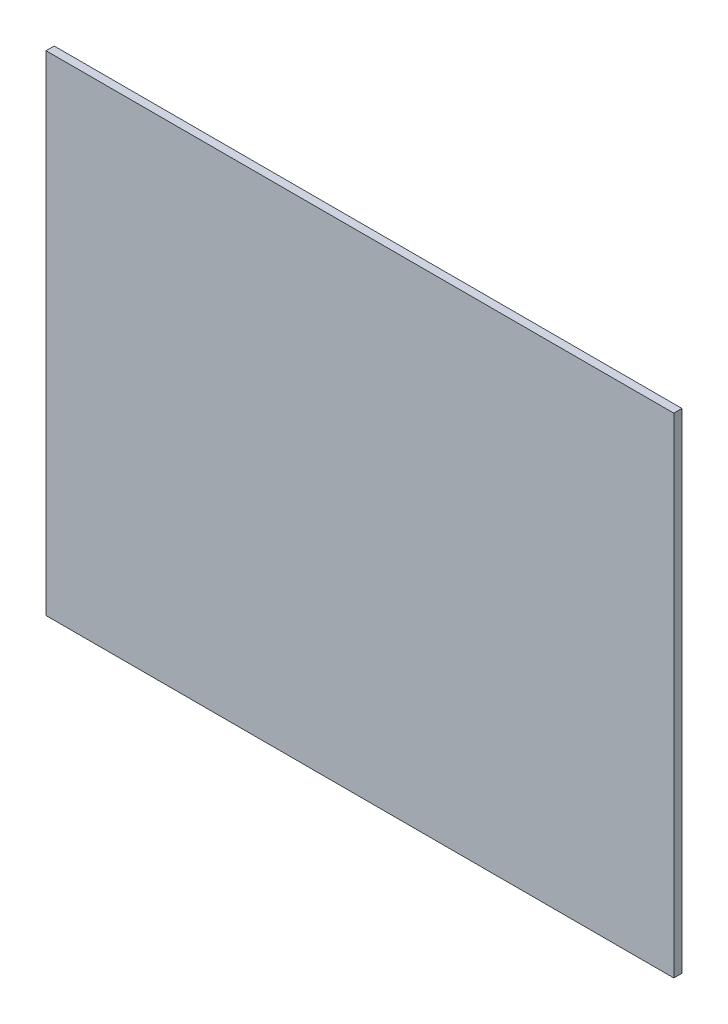
ISO-10303-21;
HEADER;
FILE_DESCRIPTION(('STEP AP214'),'2;1');
FILE_NAME('part.step','',(''),(''),'','','');
FILE_SCHEMA(('AUTOMOTIVE_DESIGN { 1 0 10303 214 1 1 1 1 }'));
ENDSEC;
DATA;
#1=APPLICATION_CONTEXT('core data for automotive mechanical design processes');
#2=APPLICATION_PROTOCOL_DEFINITION('international standard','automotive_design',2000,#1);
#3=PRODUCT_CONTEXT('',#1,'mechanical');
#4=PRODUCT('Part','Part','',(#3));
#5=PRODUCT_RELATED_PRODUCT_CATEGORY('part','',(#4));
#6=PRODUCT_DEFINITION_FORMATION('','',#4);
#7=PRODUCT_DEFINITION_CONTEXT('part definition',#1,'design');
#8=PRODUCT_DEFINITION('design','',#6,#7);
#9=PRODUCT_DEFINITION_SHAPE('','',#8);
#10=(LENGTH_UNIT() NAMED_UNIT(*) SI_UNIT(.MILLI.,.METRE.));
#11=(NAMED_UNIT(*) PLANE_ANGLE_UNIT() SI_UNIT($,.RADIAN.));
#12=(NAMED_UNIT(*) SI_UNIT($,.STERADIAN.) SOLID_ANGLE_UNIT());
#13=UNCERTAINTY_MEASURE_WITH_UNIT(LENGTH_MEASURE(1.E-05),#10,'distance_accuracy_value','');
#14=(GEOMETRIC_REPRESENTATION_CONTEXT(3) GLOBAL_UNCERTAINTY_ASSIGNED_CONTEXT((#13)) GLOBAL_UNIT_ASSIGNED_CONTEXT((#10,
#11,#12)) REPRESENTATION_CONTEXT('',''));
#15=CARTESIAN_POINT('',(0.,0.,0.));
#16=DIRECTION('',(0.,0.,1.));
#17=DIRECTION('',(1.,0.,0.));
#18=AXIS2_PLACEMENT_3D('',#15,#16,#17);
#19=CARTESIAN_POINT('',(-590.,300.,10.));
#20=DIRECTION('',(1.,0.,0.));
#21=DIRECTION('',(0.,1.,0.));
#22=AXIS2_PLACEMENT_3D('',#19,#20,#21);
#23=PLANE('',#22);
#24=DIRECTION('',(0.,-1.,0.));
#25=VECTOR('',#24,1.);
#26=CARTESIAN_POINT('',(-590.,300.,0.));
#27=LINE('',#26,#25);
#28=CARTESIAN_POINT('',(-590.,300.,0.));
#29=VERTEX_POINT('',#28);
#30=CARTESIAN_POINT('',(-590.,-300.,0.));
#31=VERTEX_POINT('',#30);
#32=EDGE_CURVE('E96',#29,#31,#27,.T.);
#33=ORIENTED_EDGE('',*,*,#32,.T.);
#34=DIRECTION('',(0.,0.,-1.));
#35=VECTOR('',#34,1.);
#36=CARTESIAN_POINT('',(-590.,-300.,10.));
#37=LINE('',#36,#35);
#38=CARTESIAN_POINT('',(-590.,-300.,10.));
#39=VERTEX_POINT('',#38);
#40=EDGE_CURVE('E11',#39,#31,#37,.T.);
#41=ORIENTED_EDGE('',*,*,#40,.F.);
#42=DIRECTION('',(0.,-1.,0.));
#43=VECTOR('',#42,1.);
#44=CARTESIAN_POINT('',(-590.,300.,10.));
#45=LINE('',#44,#43);
#46=CARTESIAN_POINT('',(-590.,300.,10.));
#47=VERTEX_POINT('',#46);
#48=EDGE_CURVE('E84',#47,#39,#45,.T.);
#49=ORIENTED_EDGE('',*,*,#48,.F.);
#50=DIRECTION('',(0.,0.,-1.));
#51=VECTOR('',#50,1.);
#52=CARTESIAN_POINT('',(-590.,300.,10.));
#53=LINE('',#52,#51);
#54=EDGE_CURVE('E92',#47,#29,#53,.T.);
#55=ORIENTED_EDGE('',*,*,#54,.T.);
#56=EDGE_LOOP('',(#33,#41,#49,#55));
#57=FACE_BOUND('',#56,.T.);
#58=ADVANCED_FACE('F33',(#57),#23,.F.);
#59=CARTESIAN_POINT('',(-590.,-300.,10.));
#60=DIRECTION('',(0.,1.,0.));
#61=DIRECTION('',(0.,0.,1.));
#62=AXIS2_PLACEMENT_3D('',#59,#60,#61);
#63=PLANE('',#62);
#64=DIRECTION('',(1.,0.,0.));
#65=VECTOR('',#64,1.);
#66=CARTESIAN_POINT('',(-590.,-300.,0.));
#67=LINE('',#66,#65);
#68=CARTESIAN_POINT('',(180.,-300.,0.));
#69=VERTEX_POINT('',#68);
#70=EDGE_CURVE('E88',#31,#69,#67,.T.);
#71=ORIENTED_EDGE('',*,*,#70,.T.);
#72=DIRECTION('',(0.,0.,-1.));
#73=VECTOR('',#72,1.);
#74=CARTESIAN_POINT('',(180.,-300.,10.));
#75=LINE('',#74,#73);
#76=CARTESIAN_POINT('',(180.,-300.,10.));
#77=VERTEX_POINT('',#76);
#78=EDGE_CURVE('E41',#77,#69,#75,.T.);
#79=ORIENTED_EDGE('',*,*,#78,.F.);
#80=DIRECTION('',(1.,0.,0.));
#81=VECTOR('',#80,1.);
#82=CARTESIAN_POINT('',(-590.,-300.,10.));
#83=LINE('',#82,#81);
#84=EDGE_CURVE('E79',#39,#77,#83,.T.);
#85=ORIENTED_EDGE('',*,*,#84,.F.);
#86=ORIENTED_EDGE('',*,*,#40,.T.);
#87=EDGE_LOOP('',(#71,#79,#85,#86));
#88=FACE_BOUND('',#87,.T.);
#89=ADVANCED_FACE('F87',(#88),#63,.F.);
#90=CARTESIAN_POINT('',(180.,300.,10.));
#91=DIRECTION('',(-1.,0.,0.));
#92=DIRECTION('',(0.,-1.,0.));
#93=AXIS2_PLACEMENT_3D('',#90,#91,#92);
#94=PLANE('',#93);
#95=DIRECTION('',(0.,1.,0.));
#96=VECTOR('',#95,1.);
#97=CARTESIAN_POINT('',(180.,300.,0.));
#98=LINE('',#97,#96);
#99=CARTESIAN_POINT('',(180.,300.,0.));
#100=VERTEX_POINT('',#99);
#101=EDGE_CURVE('E66',#69,#100,#98,.T.);
#102=ORIENTED_EDGE('',*,*,#101,.T.);
#103=DIRECTION('',(0.,0.,-1.));
#104=VECTOR('',#103,1.);
#105=CARTESIAN_POINT('',(180.,300.,10.));
#106=LINE('',#105,#104);
#107=CARTESIAN_POINT('',(180.,300.,10.));
#108=VERTEX_POINT('',#107);
#109=EDGE_CURVE('E89',#108,#100,#106,.T.);
#110=ORIENTED_EDGE('',*,*,#109,.F.);
#111=DIRECTION('',(0.,1.,0.));
#112=VECTOR('',#111,1.);
#113=CARTESIAN_POINT('',(180.,300.,10.));
#114=LINE('',#113,#112);
#115=EDGE_CURVE('E82',#77,#108,#114,.T.);
#116=ORIENTED_EDGE('',*,*,#115,.F.);
#117=ORIENTED_EDGE('',*,*,#78,.T.);
#118=EDGE_LOOP('',(#102,#110,#116,#117));
#119=FACE_BOUND('',#118,.T.);
#120=ADVANCED_FACE('F90',(#119),#94,.F.);
#121=CARTESIAN_POINT('',(-590.,300.,10.));
#122=DIRECTION('',(0.,-1.,0.));
#123=DIRECTION('',(1.,0.,0.));
#124=AXIS2_PLACEMENT_3D('',#121,#122,#123);
#125=PLANE('',#124);
#126=DIRECTION('',(-1.,0.,0.));
#127=VECTOR('',#126,1.);
#128=CARTESIAN_POINT('',(-590.,300.,0.));
#129=LINE('',#128,#127);
#130=EDGE_CURVE('E72',#100,#29,#129,.T.);
#131=ORIENTED_EDGE('',*,*,#130,.T.);
#132=ORIENTED_EDGE('',*,*,#54,.F.);
#133=DIRECTION('',(-1.,0.,0.));
#134=VECTOR('',#133,1.);
#135=CARTESIAN_POINT('',(-590.,300.,10.));
#136=LINE('',#135,#134);
#137=EDGE_CURVE('E49',#108,#47,#136,.T.);
#138=ORIENTED_EDGE('',*,*,#137,.F.);
#139=ORIENTED_EDGE('',*,*,#109,.T.);
#140=EDGE_LOOP('',(#131,#132,#138,#139));
#141=FACE_BOUND('',#140,.T.);
#142=ADVANCED_FACE('F103',(#141),#125,.F.);
#143=CARTESIAN_POINT('',(0.,0.,10.));
#144=DIRECTION('',(0.,0.,1.));
#145=DIRECTION('',(1.,0.,0.));
#146=AXIS2_PLACEMENT_3D('',#143,#144,#145);
#147=PLANE('',#146);
#148=ORIENTED_EDGE('',*,*,#48,.T.);
#149=ORIENTED_EDGE('',*,*,#84,.T.);
#150=ORIENTED_EDGE('',*,*,#115,.T.);
#151=ORIENTED_EDGE('',*,*,#137,.T.);
#152=EDGE_LOOP('',(#148,#149,#150,#151));
#153=FACE_BOUND('',#152,.T.);
#154=ADVANCED_FACE('F80',(#153),#147,.T.);
#155=CARTESIAN_POINT('',(0.,0.,0.));
#156=DIRECTION('',(0.,0.,1.));
#157=DIRECTION('',(1.,0.,0.));
#158=AXIS2_PLACEMENT_3D('',#155,#156,#157);
#159=PLANE('',#158);
#160=ORIENTED_EDGE('',*,*,#32,.F.);
#161=ORIENTED_EDGE('',*,*,#130,.F.);
#162=ORIENTED_EDGE('',*,*,#101,.F.);
#163=ORIENTED_EDGE('',*,*,#70,.F.);
#164=EDGE_LOOP('',(#160,#161,#162,#163));
#165=FACE_BOUND('',#164,.T.);
#166=ADVANCED_FACE('F106',(#165),#159,.F.);
#167=CLOSED_SHELL('',(#58,#89,#120,#142,#154,#166));
#168=MANIFOLD_SOLID_BREP('B2',#167);
#169=ADVANCED_BREP_SHAPE_REPRESENTATION('',(#18,#168),#14);
#170=SHAPE_DEFINITION_REPRESENTATION(#9,#169);
ENDSEC;
END-ISO-10303-21;
